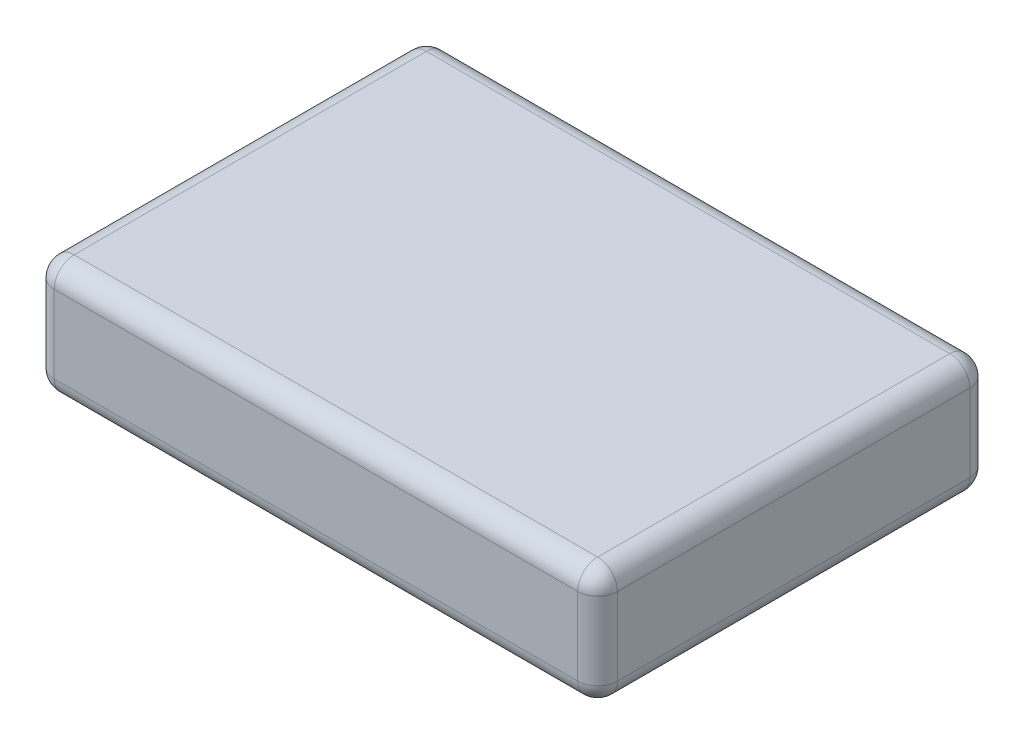
ISO-10303-21;
HEADER;
FILE_DESCRIPTION(('STEP AP214'),'2;1');
FILE_NAME('part.step','',(''),(''),'','','');
FILE_SCHEMA(('AUTOMOTIVE_DESIGN { 1 0 10303 214 1 1 1 1 }'));
ENDSEC;
DATA;
#1=APPLICATION_CONTEXT('core data for automotive mechanical design processes');
#2=APPLICATION_PROTOCOL_DEFINITION('international standard','automotive_design',2000,#1);
#3=PRODUCT_CONTEXT('',#1,'mechanical');
#4=PRODUCT('Part','Part','',(#3));
#5=PRODUCT_RELATED_PRODUCT_CATEGORY('part','',(#4));
#6=PRODUCT_DEFINITION_FORMATION('','',#4);
#7=PRODUCT_DEFINITION_CONTEXT('part definition',#1,'design');
#8=PRODUCT_DEFINITION('design','',#6,#7);
#9=PRODUCT_DEFINITION_SHAPE('','',#8);
#10=(LENGTH_UNIT() NAMED_UNIT(*) SI_UNIT(.MILLI.,.METRE.));
#11=(NAMED_UNIT(*) PLANE_ANGLE_UNIT() SI_UNIT($,.RADIAN.));
#12=(NAMED_UNIT(*) SI_UNIT($,.STERADIAN.) SOLID_ANGLE_UNIT());
#13=UNCERTAINTY_MEASURE_WITH_UNIT(LENGTH_MEASURE(1.E-05),#10,'distance_accuracy_value','');
#14=(GEOMETRIC_REPRESENTATION_CONTEXT(3) GLOBAL_UNCERTAINTY_ASSIGNED_CONTEXT((#13)) GLOBAL_UNIT_ASSIGNED_CONTEXT((#10,
#11,#12)) REPRESENTATION_CONTEXT('',''));
#15=CARTESIAN_POINT('',(0.,0.,0.));
#16=DIRECTION('',(0.,0.,1.));
#17=DIRECTION('',(1.,0.,0.));
#18=AXIS2_PLACEMENT_3D('',#15,#16,#17);
#19=CARTESIAN_POINT('',(-35.941,14.986,-25.019));
#20=DIRECTION('',(1.,0.,0.));
#21=DIRECTION('',(0.,0.,-1.));
#22=AXIS2_PLACEMENT_3D('',#19,#20,#21);
#23=PLANE('',#22);
#24=DIRECTION('',(0.,-1.,0.));
#25=VECTOR('',#24,1.);
#26=CARTESIAN_POINT('',(-35.941,14.986,22.479));
#27=LINE('',#26,#25);
#28=CARTESIAN_POINT('',(-35.941,2.54,22.479));
#29=VERTEX_POINT('',#28);
#30=CARTESIAN_POINT('',(-35.941,12.446,22.479));
#31=VERTEX_POINT('',#30);
#32=EDGE_CURVE('E132',#29,#31,#27,.F.);
#33=ORIENTED_EDGE('',*,*,#32,.T.);
#34=DIRECTION('',(0.,0.,1.));
#35=VECTOR('',#34,1.);
#36=CARTESIAN_POINT('',(-35.941,12.446,-25.019));
#37=LINE('',#36,#35);
#38=CARTESIAN_POINT('',(-35.941,12.446,-22.479));
#39=VERTEX_POINT('',#38);
#40=EDGE_CURVE('E169',#31,#39,#37,.F.);
#41=ORIENTED_EDGE('',*,*,#40,.T.);
#42=DIRECTION('',(0.,-1.,0.));
#43=VECTOR('',#42,1.);
#44=CARTESIAN_POINT('',(-35.941,14.986,-22.479));
#45=LINE('',#44,#43);
#46=CARTESIAN_POINT('',(-35.941,2.54,-22.479));
#47=VERTEX_POINT('',#46);
#48=EDGE_CURVE('E166',#39,#47,#45,.T.);
#49=ORIENTED_EDGE('',*,*,#48,.T.);
#50=DIRECTION('',(0.,0.,1.));
#51=VECTOR('',#50,1.);
#52=CARTESIAN_POINT('',(-35.941,2.54,25.019));
#53=LINE('',#52,#51);
#54=EDGE_CURVE('E161',#47,#29,#53,.T.);
#55=ORIENTED_EDGE('',*,*,#54,.T.);
#56=EDGE_LOOP('',(#33,#41,#49,#55));
#57=FACE_BOUND('',#56,.T.);
#58=ADVANCED_FACE('F37',(#57),#23,.F.);
#59=CARTESIAN_POINT('',(35.941,14.986,25.019));
#60=DIRECTION('',(0.,0.,-1.));
#61=DIRECTION('',(-1.,0.,0.));
#62=AXIS2_PLACEMENT_3D('',#59,#60,#61);
#63=PLANE('',#62);
#64=DIRECTION('',(0.,-1.,0.));
#65=VECTOR('',#64,1.);
#66=CARTESIAN_POINT('',(33.401,14.986,25.019));
#67=LINE('',#66,#65);
#68=CARTESIAN_POINT('',(33.401,2.54,25.019));
#69=VERTEX_POINT('',#68);
#70=CARTESIAN_POINT('',(33.401,12.446,25.019));
#71=VERTEX_POINT('',#70);
#72=EDGE_CURVE('E154',#69,#71,#67,.F.);
#73=ORIENTED_EDGE('',*,*,#72,.T.);
#74=DIRECTION('',(1.,0.,0.));
#75=VECTOR('',#74,1.);
#76=CARTESIAN_POINT('',(35.941,12.446,25.019));
#77=LINE('',#76,#75);
#78=CARTESIAN_POINT('',(-33.401,12.446,25.019));
#79=VERTEX_POINT('',#78);
#80=EDGE_CURVE('E158',#71,#79,#77,.F.);
#81=ORIENTED_EDGE('',*,*,#80,.T.);
#82=DIRECTION('',(0.,-1.,0.));
#83=VECTOR('',#82,1.);
#84=CARTESIAN_POINT('',(-33.401,14.986,25.019));
#85=LINE('',#84,#83);
#86=CARTESIAN_POINT('',(-33.401,2.54,25.019));
#87=VERTEX_POINT('',#86);
#88=EDGE_CURVE('E130',#79,#87,#85,.T.);
#89=ORIENTED_EDGE('',*,*,#88,.T.);
#90=DIRECTION('',(1.,0.,0.));
#91=VECTOR('',#90,1.);
#92=CARTESIAN_POINT('',(35.941,2.54,25.019));
#93=LINE('',#92,#91);
#94=EDGE_CURVE('E148',#87,#69,#93,.T.);
#95=ORIENTED_EDGE('',*,*,#94,.T.);
#96=EDGE_LOOP('',(#73,#81,#89,#95));
#97=FACE_BOUND('',#96,.T.);
#98=ADVANCED_FACE('F156',(#97),#63,.F.);
#99=CARTESIAN_POINT('',(35.941,14.986,-25.019));
#100=DIRECTION('',(-1.,0.,0.));
#101=DIRECTION('',(0.,0.,1.));
#102=AXIS2_PLACEMENT_3D('',#99,#100,#101);
#103=PLANE('',#102);
#104=DIRECTION('',(0.,-1.,0.));
#105=VECTOR('',#104,1.);
#106=CARTESIAN_POINT('',(35.941,14.986,-22.479));
#107=LINE('',#106,#105);
#108=CARTESIAN_POINT('',(35.941,2.54,-22.479));
#109=VERTEX_POINT('',#108);
#110=CARTESIAN_POINT('',(35.941,12.446,-22.479));
#111=VERTEX_POINT('',#110);
#112=EDGE_CURVE('E173',#109,#111,#107,.F.);
#113=ORIENTED_EDGE('',*,*,#112,.T.);
#114=DIRECTION('',(0.,0.,-1.));
#115=VECTOR('',#114,1.);
#116=CARTESIAN_POINT('',(35.941,12.446,-25.019));
#117=LINE('',#116,#115);
#118=CARTESIAN_POINT('',(35.941,12.446,22.479));
#119=VERTEX_POINT('',#118);
#120=EDGE_CURVE('E178',#111,#119,#117,.F.);
#121=ORIENTED_EDGE('',*,*,#120,.T.);
#122=DIRECTION('',(0.,-1.,0.));
#123=VECTOR('',#122,1.);
#124=CARTESIAN_POINT('',(35.941,14.986,22.479));
#125=LINE('',#124,#123);
#126=CARTESIAN_POINT('',(35.941,2.54,22.479));
#127=VERTEX_POINT('',#126);
#128=EDGE_CURVE('E175',#119,#127,#125,.T.);
#129=ORIENTED_EDGE('',*,*,#128,.T.);
#130=DIRECTION('',(0.,0.,-1.));
#131=VECTOR('',#130,1.);
#132=CARTESIAN_POINT('',(35.941,2.54,-25.019));
#133=LINE('',#132,#131);
#134=EDGE_CURVE('E171',#127,#109,#133,.T.);
#135=ORIENTED_EDGE('',*,*,#134,.T.);
#136=EDGE_LOOP('',(#113,#121,#129,#135));
#137=FACE_BOUND('',#136,.T.);
#138=ADVANCED_FACE('F283',(#137),#103,.F.);
#139=CARTESIAN_POINT('',(35.941,14.986,-25.019));
#140=DIRECTION('',(0.,0.,1.));
#141=DIRECTION('',(1.,0.,0.));
#142=AXIS2_PLACEMENT_3D('',#139,#140,#141);
#143=PLANE('',#142);
#144=DIRECTION('',(0.,-1.,0.));
#145=VECTOR('',#144,1.);
#146=CARTESIAN_POINT('',(-33.401,14.986,-25.019));
#147=LINE('',#146,#145);
#148=CARTESIAN_POINT('',(-33.401,2.54,-25.019));
#149=VERTEX_POINT('',#148);
#150=CARTESIAN_POINT('',(-33.401,12.446,-25.019));
#151=VERTEX_POINT('',#150);
#152=EDGE_CURVE('E182',#149,#151,#147,.F.);
#153=ORIENTED_EDGE('',*,*,#152,.T.);
#154=DIRECTION('',(-1.,0.,0.));
#155=VECTOR('',#154,1.);
#156=CARTESIAN_POINT('',(35.941,12.446,-25.019));
#157=LINE('',#156,#155);
#158=CARTESIAN_POINT('',(33.401,12.446,-25.019));
#159=VERTEX_POINT('',#158);
#160=EDGE_CURVE('E187',#151,#159,#157,.F.);
#161=ORIENTED_EDGE('',*,*,#160,.T.);
#162=DIRECTION('',(0.,-1.,0.));
#163=VECTOR('',#162,1.);
#164=CARTESIAN_POINT('',(33.401,14.986,-25.019));
#165=LINE('',#164,#163);
#166=CARTESIAN_POINT('',(33.401,2.54,-25.019));
#167=VERTEX_POINT('',#166);
#168=EDGE_CURVE('E184',#159,#167,#165,.T.);
#169=ORIENTED_EDGE('',*,*,#168,.T.);
#170=DIRECTION('',(-1.,0.,0.));
#171=VECTOR('',#170,1.);
#172=CARTESIAN_POINT('',(-35.941,2.54,-25.019));
#173=LINE('',#172,#171);
#174=EDGE_CURVE('E180',#167,#149,#173,.T.);
#175=ORIENTED_EDGE('',*,*,#174,.T.);
#176=EDGE_LOOP('',(#153,#161,#169,#175));
#177=FACE_BOUND('',#176,.T.);
#178=ADVANCED_FACE('F293',(#177),#143,.F.);
#179=CARTESIAN_POINT('',(0.,14.986,0.));
#180=DIRECTION('',(0.,-1.,0.));
#181=DIRECTION('',(0.,0.,-1.));
#182=AXIS2_PLACEMENT_3D('',#179,#180,#181);
#183=PLANE('',#182);
#184=DIRECTION('',(0.,0.,-1.));
#185=VECTOR('',#184,1.);
#186=CARTESIAN_POINT('',(33.401,14.986,0.));
#187=LINE('',#186,#185);
#188=CARTESIAN_POINT('',(33.401,14.986,22.479));
#189=VERTEX_POINT('',#188);
#190=CARTESIAN_POINT('',(33.401,14.986,-22.479));
#191=VERTEX_POINT('',#190);
#192=EDGE_CURVE('E193',#189,#191,#187,.T.);
#193=ORIENTED_EDGE('',*,*,#192,.T.);
#194=DIRECTION('',(-1.,0.,0.));
#195=VECTOR('',#194,1.);
#196=CARTESIAN_POINT('',(0.,14.986,-22.479));
#197=LINE('',#196,#195);
#198=CARTESIAN_POINT('',(-33.401,14.986,-22.479));
#199=VERTEX_POINT('',#198);
#200=EDGE_CURVE('E195',#191,#199,#197,.T.);
#201=ORIENTED_EDGE('',*,*,#200,.T.);
#202=DIRECTION('',(0.,0.,1.));
#203=VECTOR('',#202,1.);
#204=CARTESIAN_POINT('',(-33.401,14.986,0.));
#205=LINE('',#204,#203);
#206=CARTESIAN_POINT('',(-33.401,14.986,22.479));
#207=VERTEX_POINT('',#206);
#208=EDGE_CURVE('E189',#199,#207,#205,.T.);
#209=ORIENTED_EDGE('',*,*,#208,.T.);
#210=DIRECTION('',(1.,0.,0.));
#211=VECTOR('',#210,1.);
#212=CARTESIAN_POINT('',(0.,14.986,22.479));
#213=LINE('',#212,#211);
#214=EDGE_CURVE('E191',#207,#189,#213,.T.);
#215=ORIENTED_EDGE('',*,*,#214,.T.);
#216=EDGE_LOOP('',(#193,#201,#209,#215));
#217=FACE_BOUND('',#216,.T.);
#218=ADVANCED_FACE('F275',(#217),#183,.F.);
#219=CARTESIAN_POINT('',(0.,0.,0.));
#220=DIRECTION('',(0.,-1.,0.));
#221=DIRECTION('',(0.,0.,-1.));
#222=AXIS2_PLACEMENT_3D('',#219,#220,#221);
#223=PLANE('',#222);
#224=DIRECTION('',(0.,0.,1.));
#225=VECTOR('',#224,1.);
#226=CARTESIAN_POINT('',(-33.401,0.,-25.019));
#227=LINE('',#226,#225);
#228=CARTESIAN_POINT('',(-33.401,0.,22.479));
#229=VERTEX_POINT('',#228);
#230=CARTESIAN_POINT('',(-33.401,0.,-22.479));
#231=VERTEX_POINT('',#230);
#232=EDGE_CURVE('E198',#229,#231,#227,.F.);
#233=ORIENTED_EDGE('',*,*,#232,.T.);
#234=DIRECTION('',(-1.,0.,0.));
#235=VECTOR('',#234,1.);
#236=CARTESIAN_POINT('',(35.941,0.,-22.479));
#237=LINE('',#236,#235);
#238=CARTESIAN_POINT('',(33.401,0.,-22.479));
#239=VERTEX_POINT('',#238);
#240=EDGE_CURVE('E11',#231,#239,#237,.F.);
#241=ORIENTED_EDGE('',*,*,#240,.T.);
#242=DIRECTION('',(0.,0.,-1.));
#243=VECTOR('',#242,1.);
#244=CARTESIAN_POINT('',(33.401,0.,25.019));
#245=LINE('',#244,#243);
#246=CARTESIAN_POINT('',(33.401,0.,22.479));
#247=VERTEX_POINT('',#246);
#248=EDGE_CURVE('E46',#239,#247,#245,.F.);
#249=ORIENTED_EDGE('',*,*,#248,.T.);
#250=DIRECTION('',(1.,0.,0.));
#251=VECTOR('',#250,1.);
#252=CARTESIAN_POINT('',(-35.941,0.,22.479));
#253=LINE('',#252,#251);
#254=EDGE_CURVE('E200',#247,#229,#253,.F.);
#255=ORIENTED_EDGE('',*,*,#254,.T.);
#256=EDGE_LOOP('',(#233,#241,#249,#255));
#257=FACE_BOUND('',#256,.T.);
#258=ADVANCED_FACE('F521',(#257),#223,.T.);
#259=CARTESIAN_POINT('',(33.401,14.986,-22.479));
#260=DIRECTION('',(0.,-1.,0.));
#261=DIRECTION('',(0.,0.,-1.));
#262=AXIS2_PLACEMENT_3D('',#259,#260,#261);
#263=CYLINDRICAL_SURFACE('',#262,2.54);
#264=CARTESIAN_POINT('',(33.401,12.446,-22.479));
#265=DIRECTION('',(0.,1.,0.));
#266=DIRECTION('',(0.,0.,1.));
#267=AXIS2_PLACEMENT_3D('',#264,#265,#266);
#268=CIRCLE('',#267,2.54);
#269=EDGE_CURVE('E41',#111,#159,#268,.T.);
#270=ORIENTED_EDGE('',*,*,#269,.F.);
#271=ORIENTED_EDGE('',*,*,#112,.F.);
#272=CARTESIAN_POINT('',(33.401,2.54,-22.479));
#273=DIRECTION('',(0.,-1.,0.));
#274=DIRECTION('',(0.,0.,-1.));
#275=AXIS2_PLACEMENT_3D('',#272,#273,#274);
#276=CIRCLE('',#275,2.54);
#277=EDGE_CURVE('E253',#167,#109,#276,.T.);
#278=ORIENTED_EDGE('',*,*,#277,.F.);
#279=ORIENTED_EDGE('',*,*,#168,.F.);
#280=EDGE_LOOP('',(#270,#271,#278,#279));
#281=FACE_BOUND('',#280,.T.);
#282=ADVANCED_FACE('F39',(#281),#263,.T.);
#283=CARTESIAN_POINT('',(33.401,12.446,-22.479));
#284=DIRECTION('',(0.,0.,-1.));
#285=DIRECTION('',(-1.,0.,0.));
#286=AXIS2_PLACEMENT_3D('',#283,#284,#285);
#287=SPHERICAL_SURFACE('',#286,2.54);
#288=CARTESIAN_POINT('',(33.401,12.446,-22.479));
#289=DIRECTION('',(0.,0.,-1.));
#290=DIRECTION('',(-1.,0.,0.));
#291=AXIS2_PLACEMENT_3D('',#288,#289,#290);
#292=CIRCLE('',#291,2.54);
#293=EDGE_CURVE('E248',#111,#191,#292,.F.);
#294=ORIENTED_EDGE('',*,*,#293,.F.);
#295=ORIENTED_EDGE('',*,*,#269,.T.);
#296=CARTESIAN_POINT('',(33.401,12.446,-22.479));
#297=DIRECTION('',(1.,0.,0.));
#298=DIRECTION('',(0.,0.,-1.));
#299=AXIS2_PLACEMENT_3D('',#296,#297,#298);
#300=CIRCLE('',#299,2.54);
#301=EDGE_CURVE('E251',#191,#159,#300,.F.);
#302=ORIENTED_EDGE('',*,*,#301,.F.);
#303=EDGE_LOOP('',(#294,#295,#302));
#304=FACE_BOUND('',#303,.T.);
#305=ADVANCED_FACE('F263',(#304),#287,.T.);
#306=CARTESIAN_POINT('',(33.401,2.54,-22.479));
#307=DIRECTION('',(1.,0.,0.));
#308=DIRECTION('',(0.,1.,0.));
#309=AXIS2_PLACEMENT_3D('',#306,#307,#308);
#310=SPHERICAL_SURFACE('',#309,2.54);
#311=CARTESIAN_POINT('',(33.401,2.54,-22.479));
#312=DIRECTION('',(1.,0.,0.));
#313=DIRECTION('',(0.,0.,-1.));
#314=AXIS2_PLACEMENT_3D('',#311,#312,#313);
#315=CIRCLE('',#314,2.54);
#316=EDGE_CURVE('E243',#167,#239,#315,.F.);
#317=ORIENTED_EDGE('',*,*,#316,.F.);
#318=ORIENTED_EDGE('',*,*,#277,.T.);
#319=CARTESIAN_POINT('',(33.401,2.54,-22.479));
#320=DIRECTION('',(0.,0.,-1.));
#321=DIRECTION('',(-1.,0.,0.));
#322=AXIS2_PLACEMENT_3D('',#319,#320,#321);
#323=CIRCLE('',#322,2.54);
#324=EDGE_CURVE('E246',#239,#109,#323,.F.);
#325=ORIENTED_EDGE('',*,*,#324,.F.);
#326=EDGE_LOOP('',(#317,#318,#325));
#327=FACE_BOUND('',#326,.T.);
#328=ADVANCED_FACE('F494',(#327),#310,.T.);
#329=CARTESIAN_POINT('',(0.,12.446,-22.479));
#330=DIRECTION('',(-1.,0.,0.));
#331=DIRECTION('',(0.,0.,1.));
#332=AXIS2_PLACEMENT_3D('',#329,#330,#331);
#333=CYLINDRICAL_SURFACE('',#332,2.54);
#334=ORIENTED_EDGE('',*,*,#301,.T.);
#335=ORIENTED_EDGE('',*,*,#160,.F.);
#336=CARTESIAN_POINT('',(-33.401,12.446,-22.479));
#337=DIRECTION('',(-1.,0.,0.));
#338=DIRECTION('',(0.,0.,1.));
#339=AXIS2_PLACEMENT_3D('',#336,#337,#338);
#340=CIRCLE('',#339,2.54);
#341=EDGE_CURVE('E237',#199,#151,#340,.T.);
#342=ORIENTED_EDGE('',*,*,#341,.F.);
#343=ORIENTED_EDGE('',*,*,#200,.F.);
#344=EDGE_LOOP('',(#334,#335,#342,#343));
#345=FACE_BOUND('',#344,.T.);
#346=ADVANCED_FACE('F271',(#345),#333,.T.);
#347=CARTESIAN_POINT('',(33.401,12.446,0.));
#348=DIRECTION('',(0.,0.,-1.));
#349=DIRECTION('',(-1.,0.,0.));
#350=AXIS2_PLACEMENT_3D('',#347,#348,#349);
#351=CYLINDRICAL_SURFACE('',#350,2.54);
#352=ORIENTED_EDGE('',*,*,#293,.T.);
#353=ORIENTED_EDGE('',*,*,#192,.F.);
#354=CARTESIAN_POINT('',(33.401,12.446,22.479));
#355=DIRECTION('',(0.,0.,1.));
#356=DIRECTION('',(1.,0.,0.));
#357=AXIS2_PLACEMENT_3D('',#354,#355,#356);
#358=CIRCLE('',#357,2.54);
#359=EDGE_CURVE('E234',#119,#189,#358,.T.);
#360=ORIENTED_EDGE('',*,*,#359,.F.);
#361=ORIENTED_EDGE('',*,*,#120,.F.);
#362=EDGE_LOOP('',(#352,#353,#360,#361));
#363=FACE_BOUND('',#362,.T.);
#364=ADVANCED_FACE('F280',(#363),#351,.T.);
#365=CARTESIAN_POINT('',(33.401,14.986,22.479));
#366=DIRECTION('',(0.,-1.,0.));
#367=DIRECTION('',(0.,0.,-1.));
#368=AXIS2_PLACEMENT_3D('',#365,#366,#367);
#369=CYLINDRICAL_SURFACE('',#368,2.54);
#370=CARTESIAN_POINT('',(33.401,2.54,22.479));
#371=DIRECTION('',(0.,-1.,0.));
#372=DIRECTION('',(0.,0.,-1.));
#373=AXIS2_PLACEMENT_3D('',#370,#371,#372);
#374=CIRCLE('',#373,2.54);
#375=EDGE_CURVE('E228',#127,#69,#374,.T.);
#376=ORIENTED_EDGE('',*,*,#375,.F.);
#377=ORIENTED_EDGE('',*,*,#128,.F.);
#378=CARTESIAN_POINT('',(33.401,12.446,22.479));
#379=DIRECTION('',(0.,1.,0.));
#380=DIRECTION('',(0.,0.,1.));
#381=AXIS2_PLACEMENT_3D('',#378,#379,#380);
#382=CIRCLE('',#381,2.54);
#383=EDGE_CURVE('E231',#71,#119,#382,.T.);
#384=ORIENTED_EDGE('',*,*,#383,.F.);
#385=ORIENTED_EDGE('',*,*,#72,.F.);
#386=EDGE_LOOP('',(#376,#377,#384,#385));
#387=FACE_BOUND('',#386,.T.);
#388=ADVANCED_FACE('F287',(#387),#369,.T.);
#389=CARTESIAN_POINT('',(33.401,2.54,-25.019));
#390=DIRECTION('',(0.,0.,1.));
#391=DIRECTION('',(1.,0.,0.));
#392=AXIS2_PLACEMENT_3D('',#389,#390,#391);
#393=CYLINDRICAL_SURFACE('',#392,2.54);
#394=ORIENTED_EDGE('',*,*,#324,.T.);
#395=ORIENTED_EDGE('',*,*,#134,.F.);
#396=CARTESIAN_POINT('',(33.401,2.54,22.479));
#397=DIRECTION('',(0.,0.,1.));
#398=DIRECTION('',(1.,0.,0.));
#399=AXIS2_PLACEMENT_3D('',#396,#397,#398);
#400=CIRCLE('',#399,2.54);
#401=EDGE_CURVE('E226',#247,#127,#400,.T.);
#402=ORIENTED_EDGE('',*,*,#401,.F.);
#403=ORIENTED_EDGE('',*,*,#248,.F.);
#404=EDGE_LOOP('',(#394,#395,#402,#403));
#405=FACE_BOUND('',#404,.T.);
#406=ADVANCED_FACE('F291',(#405),#393,.T.);
#407=CARTESIAN_POINT('',(35.941,2.54,-22.479));
#408=DIRECTION('',(1.,0.,0.));
#409=DIRECTION('',(0.,0.,-1.));
#410=AXIS2_PLACEMENT_3D('',#407,#408,#409);
#411=CYLINDRICAL_SURFACE('',#410,2.54);
#412=ORIENTED_EDGE('',*,*,#316,.T.);
#413=ORIENTED_EDGE('',*,*,#240,.F.);
#414=CARTESIAN_POINT('',(-33.401,2.54,-22.479));
#415=DIRECTION('',(-1.,0.,0.));
#416=DIRECTION('',(0.,0.,1.));
#417=AXIS2_PLACEMENT_3D('',#414,#415,#416);
#418=CIRCLE('',#417,2.54);
#419=EDGE_CURVE('E223',#149,#231,#418,.T.);
#420=ORIENTED_EDGE('',*,*,#419,.F.);
#421=ORIENTED_EDGE('',*,*,#174,.F.);
#422=EDGE_LOOP('',(#412,#413,#420,#421));
#423=FACE_BOUND('',#422,.T.);
#424=ADVANCED_FACE('F303',(#423),#411,.T.);
#425=CARTESIAN_POINT('',(-33.401,14.986,-22.479));
#426=DIRECTION('',(0.,-1.,0.));
#427=DIRECTION('',(0.,0.,-1.));
#428=AXIS2_PLACEMENT_3D('',#425,#426,#427);
#429=CYLINDRICAL_SURFACE('',#428,2.54);
#430=CARTESIAN_POINT('',(-33.401,12.446,-22.479));
#431=DIRECTION('',(0.,1.,0.));
#432=DIRECTION('',(0.,0.,1.));
#433=AXIS2_PLACEMENT_3D('',#430,#431,#432);
#434=CIRCLE('',#433,2.54);
#435=EDGE_CURVE('E240',#151,#39,#434,.T.);
#436=ORIENTED_EDGE('',*,*,#435,.F.);
#437=ORIENTED_EDGE('',*,*,#152,.F.);
#438=CARTESIAN_POINT('',(-33.401,2.54,-22.479));
#439=DIRECTION('',(0.,-1.,0.));
#440=DIRECTION('',(0.,0.,-1.));
#441=AXIS2_PLACEMENT_3D('',#438,#439,#440);
#442=CIRCLE('',#441,2.54);
#443=EDGE_CURVE('E220',#47,#149,#442,.T.);
#444=ORIENTED_EDGE('',*,*,#443,.F.);
#445=ORIENTED_EDGE('',*,*,#48,.F.);
#446=EDGE_LOOP('',(#436,#437,#444,#445));
#447=FACE_BOUND('',#446,.T.);
#448=ADVANCED_FACE('F298',(#447),#429,.T.);
#449=CARTESIAN_POINT('',(-33.401,12.446,-22.479));
#450=DIRECTION('',(0.,0.,-1.));
#451=DIRECTION('',(-1.,0.,0.));
#452=AXIS2_PLACEMENT_3D('',#449,#450,#451);
#453=SPHERICAL_SURFACE('',#452,2.54);
#454=ORIENTED_EDGE('',*,*,#341,.T.);
#455=ORIENTED_EDGE('',*,*,#435,.T.);
#456=CARTESIAN_POINT('',(-33.401,12.446,-22.479));
#457=DIRECTION('',(0.,0.,-1.));
#458=DIRECTION('',(0.,1.,0.));
#459=AXIS2_PLACEMENT_3D('',#456,#457,#458);
#460=CIRCLE('',#459,2.54);
#461=EDGE_CURVE('E217',#199,#39,#460,.F.);
#462=ORIENTED_EDGE('',*,*,#461,.F.);
#463=EDGE_LOOP('',(#454,#455,#462));
#464=FACE_BOUND('',#463,.T.);
#465=ADVANCED_FACE('F314',(#464),#453,.T.);
#466=CARTESIAN_POINT('',(33.401,12.446,22.479));
#467=DIRECTION('',(1.,0.,0.));
#468=DIRECTION('',(0.,0.,-1.));
#469=AXIS2_PLACEMENT_3D('',#466,#467,#468);
#470=SPHERICAL_SURFACE('',#469,2.54);
#471=ORIENTED_EDGE('',*,*,#383,.T.);
#472=ORIENTED_EDGE('',*,*,#359,.T.);
#473=CARTESIAN_POINT('',(33.401,12.446,22.479));
#474=DIRECTION('',(1.,0.,0.));
#475=DIRECTION('',(0.,0.,-1.));
#476=AXIS2_PLACEMENT_3D('',#473,#474,#475);
#477=CIRCLE('',#476,2.54);
#478=EDGE_CURVE('E214',#71,#189,#477,.F.);
#479=ORIENTED_EDGE('',*,*,#478,.F.);
#480=EDGE_LOOP('',(#471,#472,#479));
#481=FACE_BOUND('',#480,.T.);
#482=ADVANCED_FACE('F324',(#481),#470,.T.);
#483=CARTESIAN_POINT('',(33.401,2.54,22.479));
#484=DIRECTION('',(1.,0.,0.));
#485=DIRECTION('',(0.,1.,0.));
#486=AXIS2_PLACEMENT_3D('',#483,#484,#485);
#487=SPHERICAL_SURFACE('',#486,2.54);
#488=ORIENTED_EDGE('',*,*,#401,.T.);
#489=ORIENTED_EDGE('',*,*,#375,.T.);
#490=CARTESIAN_POINT('',(33.401,2.54,22.479));
#491=DIRECTION('',(1.,0.,0.));
#492=DIRECTION('',(0.,0.,-1.));
#493=AXIS2_PLACEMENT_3D('',#490,#491,#492);
#494=CIRCLE('',#493,2.54);
#495=EDGE_CURVE('E151',#247,#69,#494,.F.);
#496=ORIENTED_EDGE('',*,*,#495,.F.);
#497=EDGE_LOOP('',(#488,#489,#496));
#498=FACE_BOUND('',#497,.T.);
#499=ADVANCED_FACE('F326',(#498),#487,.T.);
#500=CARTESIAN_POINT('',(-33.401,2.54,-22.479));
#501=DIRECTION('',(0.,0.,-1.));
#502=DIRECTION('',(0.,1.,0.));
#503=AXIS2_PLACEMENT_3D('',#500,#501,#502);
#504=SPHERICAL_SURFACE('',#503,2.54);
#505=ORIENTED_EDGE('',*,*,#443,.T.);
#506=ORIENTED_EDGE('',*,*,#419,.T.);
#507=CARTESIAN_POINT('',(-33.401,2.54,-22.479));
#508=DIRECTION('',(0.,0.,-1.));
#509=DIRECTION('',(-1.,0.,0.));
#510=AXIS2_PLACEMENT_3D('',#507,#508,#509);
#511=CIRCLE('',#510,2.54);
#512=EDGE_CURVE('E210',#47,#231,#511,.F.);
#513=ORIENTED_EDGE('',*,*,#512,.F.);
#514=EDGE_LOOP('',(#505,#506,#513));
#515=FACE_BOUND('',#514,.T.);
#516=ADVANCED_FACE('F305',(#515),#504,.T.);
#517=CARTESIAN_POINT('',(-33.401,12.446,0.));
#518=DIRECTION('',(0.,0.,1.));
#519=DIRECTION('',(1.,0.,0.));
#520=AXIS2_PLACEMENT_3D('',#517,#518,#519);
#521=CYLINDRICAL_SURFACE('',#520,2.54);
#522=ORIENTED_EDGE('',*,*,#461,.T.);
#523=ORIENTED_EDGE('',*,*,#40,.F.);
#524=CARTESIAN_POINT('',(-33.401,12.446,22.479));
#525=DIRECTION('',(0.,0.,1.));
#526=DIRECTION('',(1.,0.,0.));
#527=AXIS2_PLACEMENT_3D('',#524,#525,#526);
#528=CIRCLE('',#527,2.54);
#529=EDGE_CURVE('E207',#207,#31,#528,.T.);
#530=ORIENTED_EDGE('',*,*,#529,.F.);
#531=ORIENTED_EDGE('',*,*,#208,.F.);
#532=EDGE_LOOP('',(#522,#523,#530,#531));
#533=FACE_BOUND('',#532,.T.);
#534=ADVANCED_FACE('F316',(#533),#521,.T.);
#535=CARTESIAN_POINT('',(0.,12.446,22.479));
#536=DIRECTION('',(1.,0.,0.));
#537=DIRECTION('',(0.,0.,-1.));
#538=AXIS2_PLACEMENT_3D('',#535,#536,#537);
#539=CYLINDRICAL_SURFACE('',#538,2.54);
#540=ORIENTED_EDGE('',*,*,#478,.T.);
#541=ORIENTED_EDGE('',*,*,#214,.F.);
#542=CARTESIAN_POINT('',(-33.401,12.446,22.479));
#543=DIRECTION('',(-1.,0.,0.));
#544=DIRECTION('',(0.,0.,1.));
#545=AXIS2_PLACEMENT_3D('',#542,#543,#544);
#546=CIRCLE('',#545,2.54);
#547=EDGE_CURVE('E145',#79,#207,#546,.T.);
#548=ORIENTED_EDGE('',*,*,#547,.F.);
#549=ORIENTED_EDGE('',*,*,#80,.F.);
#550=EDGE_LOOP('',(#540,#541,#548,#549));
#551=FACE_BOUND('',#550,.T.);
#552=ADVANCED_FACE('F322',(#551),#539,.T.);
#553=CARTESIAN_POINT('',(35.941,2.54,22.479));
#554=DIRECTION('',(-1.,0.,0.));
#555=DIRECTION('',(0.,0.,1.));
#556=AXIS2_PLACEMENT_3D('',#553,#554,#555);
#557=CYLINDRICAL_SURFACE('',#556,2.54);
#558=ORIENTED_EDGE('',*,*,#495,.T.);
#559=ORIENTED_EDGE('',*,*,#94,.F.);
#560=CARTESIAN_POINT('',(-33.401,2.54,22.479));
#561=DIRECTION('',(-1.,0.,0.));
#562=DIRECTION('',(0.,0.,1.));
#563=AXIS2_PLACEMENT_3D('',#560,#561,#562);
#564=CIRCLE('',#563,2.54);
#565=EDGE_CURVE('E138',#229,#87,#564,.T.);
#566=ORIENTED_EDGE('',*,*,#565,.F.);
#567=ORIENTED_EDGE('',*,*,#254,.F.);
#568=EDGE_LOOP('',(#558,#559,#566,#567));
#569=FACE_BOUND('',#568,.T.);
#570=ADVANCED_FACE('F149',(#569),#557,.T.);
#571=CARTESIAN_POINT('',(-33.401,2.54,-25.019));
#572=DIRECTION('',(0.,0.,-1.));
#573=DIRECTION('',(-1.,0.,0.));
#574=AXIS2_PLACEMENT_3D('',#571,#572,#573);
#575=CYLINDRICAL_SURFACE('',#574,2.54);
#576=ORIENTED_EDGE('',*,*,#512,.T.);
#577=ORIENTED_EDGE('',*,*,#232,.F.);
#578=CARTESIAN_POINT('',(-33.401,2.54,22.479));
#579=DIRECTION('',(0.,0.,1.));
#580=DIRECTION('',(1.,0.,0.));
#581=AXIS2_PLACEMENT_3D('',#578,#579,#580);
#582=CIRCLE('',#581,2.54);
#583=EDGE_CURVE('E142',#29,#229,#582,.T.);
#584=ORIENTED_EDGE('',*,*,#583,.F.);
#585=ORIENTED_EDGE('',*,*,#54,.F.);
#586=EDGE_LOOP('',(#576,#577,#584,#585));
#587=FACE_BOUND('',#586,.T.);
#588=ADVANCED_FACE('F309',(#587),#575,.T.);
#589=CARTESIAN_POINT('',(-33.401,12.446,22.479));
#590=DIRECTION('',(0.,1.,0.));
#591=DIRECTION('',(0.,0.,1.));
#592=AXIS2_PLACEMENT_3D('',#589,#590,#591);
#593=SPHERICAL_SURFACE('',#592,2.54);
#594=ORIENTED_EDGE('',*,*,#547,.T.);
#595=ORIENTED_EDGE('',*,*,#529,.T.);
#596=CARTESIAN_POINT('',(-33.401,12.446,22.479));
#597=DIRECTION('',(0.,1.,0.));
#598=DIRECTION('',(0.,0.,1.));
#599=AXIS2_PLACEMENT_3D('',#596,#597,#598);
#600=CIRCLE('',#599,2.54);
#601=EDGE_CURVE('E135',#79,#31,#600,.F.);
#602=ORIENTED_EDGE('',*,*,#601,.F.);
#603=EDGE_LOOP('',(#594,#595,#602));
#604=FACE_BOUND('',#603,.T.);
#605=ADVANCED_FACE('F320',(#604),#593,.T.);
#606=CARTESIAN_POINT('',(-33.401,2.54,22.479));
#607=DIRECTION('',(0.,-1.,0.));
#608=DIRECTION('',(0.,0.,-1.));
#609=AXIS2_PLACEMENT_3D('',#606,#607,#608);
#610=SPHERICAL_SURFACE('',#609,2.54);
#611=ORIENTED_EDGE('',*,*,#583,.T.);
#612=ORIENTED_EDGE('',*,*,#565,.T.);
#613=CARTESIAN_POINT('',(-33.401,2.54,22.479));
#614=DIRECTION('',(0.,-1.,0.));
#615=DIRECTION('',(0.,0.,-1.));
#616=AXIS2_PLACEMENT_3D('',#613,#614,#615);
#617=CIRCLE('',#616,2.54);
#618=EDGE_CURVE('E126',#29,#87,#617,.F.);
#619=ORIENTED_EDGE('',*,*,#618,.F.);
#620=EDGE_LOOP('',(#611,#612,#619));
#621=FACE_BOUND('',#620,.T.);
#622=ADVANCED_FACE('F140',(#621),#610,.T.);
#623=CARTESIAN_POINT('',(-33.401,14.986,22.479));
#624=DIRECTION('',(0.,-1.,0.));
#625=DIRECTION('',(0.,0.,-1.));
#626=AXIS2_PLACEMENT_3D('',#623,#624,#625);
#627=CYLINDRICAL_SURFACE('',#626,2.54);
#628=ORIENTED_EDGE('',*,*,#601,.T.);
#629=ORIENTED_EDGE('',*,*,#32,.F.);
#630=ORIENTED_EDGE('',*,*,#618,.T.);
#631=ORIENTED_EDGE('',*,*,#88,.F.);
#632=EDGE_LOOP('',(#628,#629,#630,#631));
#633=FACE_BOUND('',#632,.T.);
#634=ADVANCED_FACE('F128',(#633),#627,.T.);
#635=CLOSED_SHELL('',(#58,#98,#138,#178,#218,#258,#282,#305,#328,#346,#364,#388,#406,#424,#448,
#465,#482,#499,#516,#534,#552,#570,#588,#605,#622,#634));
#636=MANIFOLD_SOLID_BREP('B2',#635);
#637=ADVANCED_BREP_SHAPE_REPRESENTATION('',(#18,#636),#14);
#638=SHAPE_DEFINITION_REPRESENTATION(#9,#637);
ENDSEC;
END-ISO-10303-21;
